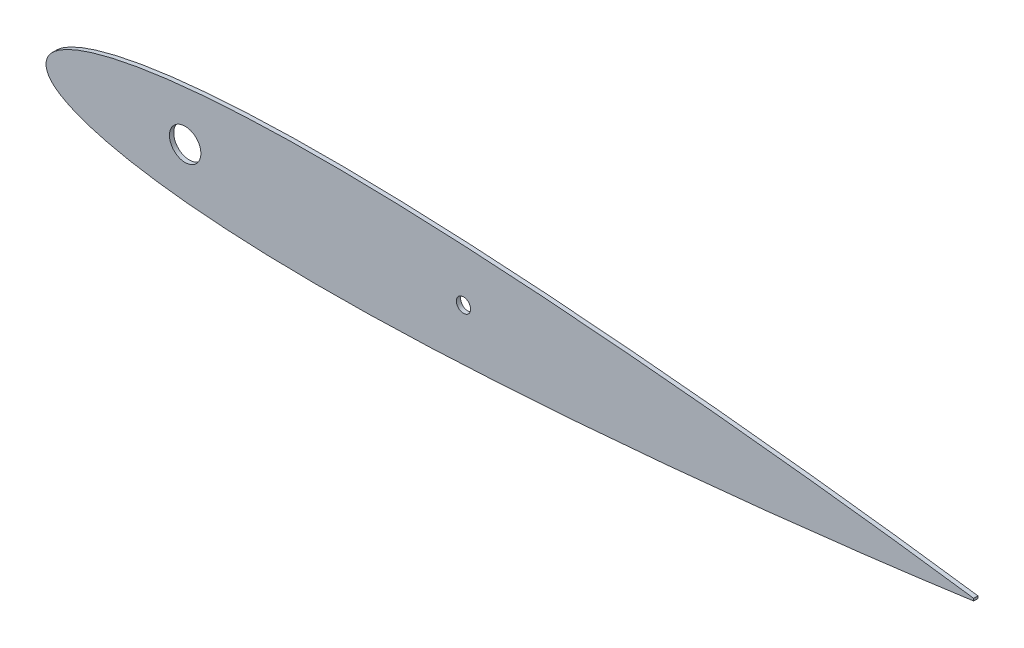
ISO-10303-21;
HEADER;
FILE_DESCRIPTION(('STEP AP214'),'2;1');
FILE_NAME('part.step','',(''),(''),'','','');
FILE_SCHEMA(('AUTOMOTIVE_DESIGN { 1 0 10303 214 1 1 1 1 }'));
ENDSEC;
DATA;
#1=APPLICATION_CONTEXT('core data for automotive mechanical design processes');
#2=APPLICATION_PROTOCOL_DEFINITION('international standard','automotive_design',2000,#1);
#3=PRODUCT_CONTEXT('',#1,'mechanical');
#4=PRODUCT('Part','Part','',(#3));
#5=PRODUCT_RELATED_PRODUCT_CATEGORY('part','',(#4));
#6=PRODUCT_DEFINITION_FORMATION('','',#4);
#7=PRODUCT_DEFINITION_CONTEXT('part definition',#1,'design');
#8=PRODUCT_DEFINITION('design','',#6,#7);
#9=PRODUCT_DEFINITION_SHAPE('','',#8);
#10=(LENGTH_UNIT() NAMED_UNIT(*) SI_UNIT(.MILLI.,.METRE.));
#11=(NAMED_UNIT(*) PLANE_ANGLE_UNIT() SI_UNIT($,.RADIAN.));
#12=(NAMED_UNIT(*) SI_UNIT($,.STERADIAN.) SOLID_ANGLE_UNIT());
#13=UNCERTAINTY_MEASURE_WITH_UNIT(LENGTH_MEASURE(1.E-05),#10,'distance_accuracy_value','');
#14=(GEOMETRIC_REPRESENTATION_CONTEXT(3) GLOBAL_UNCERTAINTY_ASSIGNED_CONTEXT((#13)) GLOBAL_UNIT_ASSIGNED_CONTEXT((#10,
#11,#12)) REPRESENTATION_CONTEXT('',''));
#15=CARTESIAN_POINT('',(0.,0.,0.));
#16=DIRECTION('',(0.,0.,1.));
#17=DIRECTION('',(1.,0.,0.));
#18=AXIS2_PLACEMENT_3D('',#15,#16,#17);
#19=CARTESIAN_POINT('',(325.,0.40950009294066,-1.5));
#20=CARTESIAN_POINT('',(324.209606779707,0.519399758052348,-1.5));
#21=CARTESIAN_POINT('',(322.004222005564,0.826045920870919,-1.5));
#22=CARTESIAN_POINT('',(318.131286115594,1.36247994030258,-1.5));
#23=CARTESIAN_POINT('',(313.205110101778,2.03042977355189,-1.5));
#24=CARTESIAN_POINT('',(307.754214134534,2.75656118582997,-1.5));
#25=CARTESIAN_POINT('',(301.981376014149,3.50796663812542,-1.5));
#26=CARTESIAN_POINT('',(296.03805070342,4.26285960586649,-1.5));
#27=CARTESIAN_POINT('',(290.014777157156,5.01477274252816,-1.5));
#28=CARTESIAN_POINT('',(283.957433959712,5.75582617177208,-1.5));
#29=CARTESIAN_POINT('',(277.884033962146,6.48070926721247,-1.5));
#30=CARTESIAN_POINT('',(271.799371840249,7.19115834138892,-1.5));
#31=CARTESIAN_POINT('',(265.708673260099,7.88859596106607,-1.5));
#32=CARTESIAN_POINT('',(259.617942627014,8.57158743858282,-1.5));
#33=CARTESIAN_POINT('',(253.527208066558,9.23757681253525,-1.5));
#34=CARTESIAN_POINT('',(247.432327629463,9.8867511540254,-1.5));
#35=CARTESIAN_POINT('',(241.332260132785,10.5225031273389,-1.5));
#36=CARTESIAN_POINT('',(235.230560492259,11.1447506557483,-1.5));
#37=CARTESIAN_POINT('',(229.13083924923,11.7508555070347,-1.5));
#38=CARTESIAN_POINT('',(223.034064985933,12.3409491955807,-1.5));
#39=CARTESIAN_POINT('',(216.939113887928,12.9142946059523,-1.5));
#40=CARTESIAN_POINT('',(210.845263014783,13.4708382241852,-1.5));
#41=CARTESIAN_POINT('',(204.753002950035,14.0095743054653,-1.5));
#42=CARTESIAN_POINT('',(198.663296519111,14.5308590099609,-1.5));
#43=CARTESIAN_POINT('',(192.576797706318,15.0327448367376,-1.5));
#44=CARTESIAN_POINT('',(186.493961902939,15.514677146349,-1.5));
#45=CARTESIAN_POINT('',(180.415624113057,15.976809619806,-1.5));
#46=CARTESIAN_POINT('',(174.342680028815,16.4170842141139,-1.5));
#47=CARTESIAN_POINT('',(168.275982363255,16.834029746551,-1.5));
#48=CARTESIAN_POINT('',(162.215629607513,17.2278742693415,-1.5));
#49=CARTESIAN_POINT('',(156.161040662733,17.5953372871967,-1.5));
#50=CARTESIAN_POINT('',(150.112779892537,17.9372096616028,-1.5));
#51=CARTESIAN_POINT('',(144.07339040427,18.2513514924439,-1.5));
#52=CARTESIAN_POINT('',(138.046350310496,18.5360668572563,-1.5));
#53=CARTESIAN_POINT('',(132.034044160048,18.7892202902569,-1.5));
#54=CARTESIAN_POINT('',(126.0357766507,19.0073658596619,-1.5));
#55=CARTESIAN_POINT('',(120.050052914781,19.1887400668421,-1.5));
#56=CARTESIAN_POINT('',(114.076331660156,19.3315438188049,-1.5));
#57=CARTESIAN_POINT('',(108.117235085,19.4351038734371,-1.5));
#58=CARTESIAN_POINT('',(102.177171609536,19.4963107318145,-1.5));
#59=CARTESIAN_POINT('',(96.2603591758063,19.5109725894809,-1.5));
#60=CARTESIAN_POINT('',(90.3701487394851,19.4775077461311,-1.5));
#61=CARTESIAN_POINT('',(84.5091329996222,19.3907618385162,-1.5));
#62=CARTESIAN_POINT('',(78.6807707597626,19.2476243031365,-1.5));
#63=CARTESIAN_POINT('',(72.8895764419092,19.0443694156848,-1.5));
#64=CARTESIAN_POINT('',(67.1420867990852,18.7758127059806,-1.5));
#65=CARTESIAN_POINT('',(61.4473554716222,18.4394562222855,-1.5));
#66=CARTESIAN_POINT('',(55.8188788592683,18.0277086658522,-1.5));
#67=CARTESIAN_POINT('',(50.2754905068751,17.5393749526799,-1.5));
#68=CARTESIAN_POINT('',(44.8436271748394,16.966812040394,-1.5));
#69=CARTESIAN_POINT('',(39.5585789155564,16.3084644660726,-1.5));
#70=CARTESIAN_POINT('',(34.4705276450858,15.5627624363054,-1.5));
#71=CARTESIAN_POINT('',(29.6466115538618,14.7371020011183,-1.5));
#72=CARTESIAN_POINT('',(25.1714180911801,13.847801872696,-1.5));
#73=CARTESIAN_POINT('',(21.1277937118719,12.9136079104224,-1.5));
#74=CARTESIAN_POINT('',(17.5697242584201,11.9649836606135,-1.5));
#75=CARTESIAN_POINT('',(14.5048810711102,11.0230017776016,-1.5));
#76=CARTESIAN_POINT('',(11.9002690745364,10.1112925690979,-1.5));
#77=CARTESIAN_POINT('',(9.70828673327445,9.23223688296203,-1.5));
#78=CARTESIAN_POINT('',(7.872827773427,8.39255923934498,-1.5));
#79=CARTESIAN_POINT('',(6.33315120465811,7.59484614670777,-1.5));
#80=CARTESIAN_POINT('',(5.03494774774102,6.82568841763676,-1.5));
#81=CARTESIAN_POINT('',(3.93051534393489,6.07372451832528,-1.5));
#82=CARTESIAN_POINT('',(2.98116190312313,5.33718940017341,-1.5));
#83=CARTESIAN_POINT('',(2.17337222995265,4.60407807520934,-1.5));
#84=CARTESIAN_POINT('',(1.50639491985586,3.86778199385349,-1.5));
#85=CARTESIAN_POINT('',(0.976010289153636,3.1318548172018,-1.5));
#86=CARTESIAN_POINT('',(0.573308222912487,2.40523809189426,-1.5));
#87=CARTESIAN_POINT('',(0.282112492358,1.69699756557867,-1.5));
#88=CARTESIAN_POINT('',(0.0927816593963797,1.00862248430008,-1.5));
#89=CARTESIAN_POINT('',(-0.00387542199195718,0.33472950833183,-1.5));
#90=CARTESIAN_POINT('',(-0.00387542199175771,-0.334729508332823,-1.5));
#91=CARTESIAN_POINT('',(0.0927816593964684,-1.00862248430101,-1.5));
#92=CARTESIAN_POINT('',(0.282112492358235,-1.69699756557957,-1.5));
#93=CARTESIAN_POINT('',(0.573308222913153,-2.40523809189516,-1.5));
#94=CARTESIAN_POINT('',(0.9760102891542,-3.13185481720265,-1.5));
#95=CARTESIAN_POINT('',(1.50639491985662,-3.8677819938538,-1.5));
#96=CARTESIAN_POINT('',(2.17337222995328,-4.60407807521171,-1.5));
#97=CARTESIAN_POINT('',(2.98116190312558,-5.33718940016606,-1.5));
#98=CARTESIAN_POINT('',(3.93051534393069,-6.07372451835894,-1.5));
#99=CARTESIAN_POINT('',(5.03494774776674,-6.8256884174897,-1.5));
#100=CARTESIAN_POINT('',(6.33315120454886,-7.59484614737165,-1.5));
#101=CARTESIAN_POINT('',(7.87282777394367,-8.3925592362581,-1.5));
#102=CARTESIAN_POINT('',(9.70828673083843,-9.23223689756835,-1.5));
#103=CARTESIAN_POINT('',(11.9002690861302,-10.1112924996382,-1.5));
#104=CARTESIAN_POINT('',(14.5048810162984,-11.023002106052,-1.5));
#105=CARTESIAN_POINT('',(17.5697245150947,-11.964982122603,-1.5));
#106=CARTESIAN_POINT('',(21.1277925315338,-12.9136149831514,-1.5));
#107=CARTESIAN_POINT('',(25.1714233397692,-13.84777042258,-1.5));
#108=CARTESIAN_POINT('',(29.6465711781048,-14.7372325178627,-1.5));
#109=CARTESIAN_POINT('',(34.4705986764644,-15.5622096745657,-1.5));
#110=CARTESIAN_POINT('',(39.5585394288991,-16.3086186388566,-1.5));
#111=CARTESIAN_POINT('',(44.8436338253308,-16.9667684771387,-1.5));
#112=CARTESIAN_POINT('',(50.2754886705653,-17.5393869812258,-1.5));
#113=CARTESIAN_POINT('',(55.8188793624641,-18.0277053697381,-1.5));
#114=CARTESIAN_POINT('',(61.447355334478,-18.439457120642,-1.5));
#115=CARTESIAN_POINT('',(67.1420868363349,-18.7758124619892,-1.5));
#116=CARTESIAN_POINT('',(72.8895764318215,-19.0443694817719,-1.5));
#117=CARTESIAN_POINT('',(78.6807707624954,-19.247624285242,-1.5));
#118=CARTESIAN_POINT('',(84.5091329988882,-19.3907618433306,-1.5));
#119=CARTESIAN_POINT('',(90.3701487396876,-19.4775077448096,-1.5));
#120=CARTESIAN_POINT('',(96.2603591757563,-19.5109725898143,-1.5));
#121=CARTESIAN_POINT('',(102.177171609554,-19.4963107316998,-1.5));
#122=CARTESIAN_POINT('',(108.117235085,-19.4351038734417,-1.5));
#123=CARTESIAN_POINT('',(114.076331660161,-19.3315438187759,-1.5));
#124=CARTESIAN_POINT('',(120.050052914784,-19.1887400668206,-1.5));
#125=CARTESIAN_POINT('',(126.035776650705,-19.0073658596369,-1.5));
#126=CARTESIAN_POINT('',(132.034044160051,-18.7892202902311,-1.5));
#127=CARTESIAN_POINT('',(138.046350310499,-18.5360668572293,-1.5));
#128=CARTESIAN_POINT('',(144.073390404273,-18.2513514924157,-1.5));
#129=CARTESIAN_POINT('',(150.11277989254,-17.9372096615734,-1.5));
#130=CARTESIAN_POINT('',(156.161040662736,-17.595337287166,-1.5));
#131=CARTESIAN_POINT('',(162.215629607516,-17.2278742693095,-1.5));
#132=CARTESIAN_POINT('',(168.275982363258,-16.8340297465178,-1.5));
#133=CARTESIAN_POINT('',(174.342680028818,-16.4170842140796,-1.5));
#134=CARTESIAN_POINT('',(180.41562411306,-15.9768096197705,-1.5));
#135=CARTESIAN_POINT('',(186.493961902942,-15.5146771463122,-1.5));
#136=CARTESIAN_POINT('',(192.57679770632,-15.0327448366995,-1.5));
#137=CARTESIAN_POINT('',(198.663296519114,-14.5308590099216,-1.5));
#138=CARTESIAN_POINT('',(204.753002950038,-14.0095743054248,-1.5));
#139=CARTESIAN_POINT('',(210.845263014786,-13.4708382241434,-1.5));
#140=CARTESIAN_POINT('',(216.93911388793,-12.9142946059093,-1.5));
#141=CARTESIAN_POINT('',(223.034064985936,-12.3409491955365,-1.5));
#142=CARTESIAN_POINT('',(229.130839249232,-11.7508555069892,-1.5));
#143=CARTESIAN_POINT('',(235.230560492261,-11.1447506557015,-1.5));
#144=CARTESIAN_POINT('',(241.332260132787,-10.5225031272909,-1.5));
#145=CARTESIAN_POINT('',(247.432327629465,-9.88675115397626,-1.5));
#146=CARTESIAN_POINT('',(253.527208066559,-9.23757681248485,-1.5));
#147=CARTESIAN_POINT('',(259.617942627016,-8.57158743853121,-1.5));
#148=CARTESIAN_POINT('',(265.7086732601,-7.88859596101316,-1.5));
#149=CARTESIAN_POINT('',(271.79937184025,-7.19115834133485,-1.5));
#150=CARTESIAN_POINT('',(277.884033962148,-6.48070926715712,-1.5));
#151=CARTESIAN_POINT('',(283.957433959714,-5.75582617171553,-1.5));
#152=CARTESIAN_POINT('',(290.014777157157,-5.01477274247036,-1.5));
#153=CARTESIAN_POINT('',(296.038050703421,-4.26285960580745,-1.5));
#154=CARTESIAN_POINT('',(301.98137601415,-3.50796663806521,-1.5));
#155=CARTESIAN_POINT('',(307.754214134535,-2.75656118576856,-1.5));
#156=CARTESIAN_POINT('',(313.205110101779,-2.0304297734894,-1.5));
#157=CARTESIAN_POINT('',(318.131286115594,-1.36247994023909,-1.5));
#158=CARTESIAN_POINT('',(322.004222005564,-0.826045920806638,-1.5));
#159=CARTESIAN_POINT('',(324.209606779707,-0.519399757987628,-1.5));
#160=CARTESIAN_POINT('',(325.,-0.409500092875768,-1.5));
#161=B_SPLINE_CURVE_WITH_KNOTS('',3,(#19,#20,#21,#22,#23,#24,#25,#26,#27,#28,#29,#30,#31,#32,
#33,#34,#35,#36,#37,#38,#39,#40,#41,#42,#43,#44,#45,#46,#47,#48,#49,#50,#51,#52,#53,#54,#55,#56,
#57,#58,#59,#60,#61,#62,#63,#64,#65,#66,#67,#68,#69,#70,#71,#72,#73,#74,#75,#76,#77,#78,#79,#80,
#81,#82,#83,#84,#85,#86,#87,#88,#89,#90,#91,#92,#93,#94,#95,#96,#97,#98,#99,#100,#101,#102,#103,
#104,#105,#106,#107,#108,#109,#110,#111,#112,#113,#114,#115,#116,#117,#118,#119,#120,#121,#122,
#123,#124,#125,#126,#127,#128,#129,#130,#131,#132,#133,#134,#135,#136,#137,#138,#139,#140,#141,
#142,#143,#144,#145,#146,#147,#148,#149,#150,#151,#152,#153,#154,#155,#156,#157,#158,#159,#160),
.UNSPECIFIED.,.F.,.F.,(4,1,1,1,1,1,1,1,1,1,1,1,1,1,1,1,1,1,1,1,1,1,1,1,1,1,1,1,1,1,1,1,1,1,1,1,
1,1,1,1,1,1,1,1,1,1,1,1,1,1,1,1,1,1,1,1,1,1,1,1,1,1,1,1,1,1,1,1,1,1,1,1,1,1,1,1,1,1,1,1,1,1,1,1,
1,1,1,1,1,1,1,1,1,1,1,1,1,1,1,1,1,1,1,1,1,1,1,1,1,1,1,1,1,1,1,1,1,1,1,1,1,1,1,1,1,1,1,1,1,1,1,1,
1,1,1,1,1,1,1,4),(0.,0.00361222059404388,0.0100789532278554,0.0176986181570895,
0.0261151107220122,0.0349709660638799,0.0440503796486832,0.0532343297369713,0.0624475697827881,
0.0716739929600303,0.0809213185094618,0.0901775382979332,0.0994243421366575,0.108664440992277,
0.117912199004999,0.127169502180609,0.136426594565023,0.145675425736823,0.154916495397513,
0.164153236916375,0.173386648526191,0.182615736180586,0.191838089492061,0.201053134496137,
0.210260392550908,0.219458942389608,0.228646746886173,0.237822316287067,0.24698522413025,
0.25613738364592,0.265279415916296,0.274406949966901,0.283512193452554,0.292591781113348,
0.30164628535433,0.310681792653752,0.31969906757785,0.32869451957993,0.337660159695399,
0.346588583205171,0.355477411634764,0.364322937295264,0.373121613643215,0.381867635356829,
0.390553004884712,0.399166025869356,0.407689628257838,0.416098119030288,0.424354887451602,
0.432412428746428,0.440204728485537,0.447630505181733,0.454563637698397,0.460855379429517,
0.466413319364109,0.471228610451128,0.475365774282038,0.478901259753558,0.481915077255184,
0.484498871900912,0.486747127386087,0.488741251833575,0.490543179252672,0.492182103901344,
0.493672830547239,0.495031907807012,0.496279059618418,0.497424736506128,0.498490165528455,
0.499502757789975,0.500497253863142,0.501509846124661,0.502575275146988,0.503720952034698,
0.504968103846104,0.506327181105877,0.507817907751772,0.509456832400444,0.511258759819541,
0.51325288426703,0.515501139752205,0.518084934397933,0.521098751899559,0.524634237371078,
0.528771401201989,0.533586692289008,0.539144632223599,0.545436373954719,0.552369506471383,
0.559795200118754,0.567587571253572,0.575645112548398,0.583901880969712,0.592310371742162,
0.600833974130644,0.609446995115288,0.618132364643171,0.626878386356785,0.635677062704736,
0.644522588365236,0.653411416794829,0.662339840304601,0.67130548042007,0.68030093242215,
0.689318207346248,0.69835371464567,0.707408218886652,0.716487806547446,0.725593050033099,
0.734720584083704,0.74386261635408,0.75301477586975,0.762177683712933,0.771353253113827,
0.780541057610392,0.789739607449093,0.798946865503863,0.808161910507939,0.817384263819414,
0.826613351473809,0.835846763083625,0.845083504602487,0.854324574263177,0.863573405434977,
0.872830497819391,0.882087800995001,0.891335559007723,0.900575657863343,0.909822461702067,
0.919078681490538,0.92832600703997,0.937552430217212,0.946765670263029,0.955949620351317,
0.96502903393612,0.973884889277988,0.982301381842911,0.989921046772145,0.996387779405956,1.),.UNSPECIFIED.);
#162=DIRECTION('',(0.,0.,1.));
#163=VECTOR('',#162,1.);
#164=SURFACE_OF_LINEAR_EXTRUSION('',#161,#163);
#165=CARTESIAN_POINT('',(325.,0.40950009294066,0.));
#166=CARTESIAN_POINT('',(324.209606779707,0.519399758052348,0.));
#167=CARTESIAN_POINT('',(322.004222005564,0.826045920870919,0.));
#168=CARTESIAN_POINT('',(318.131286115594,1.36247994030258,0.));
#169=CARTESIAN_POINT('',(313.205110101778,2.03042977355189,0.));
#170=CARTESIAN_POINT('',(307.754214134534,2.75656118582997,0.));
#171=CARTESIAN_POINT('',(301.981376014149,3.50796663812542,0.));
#172=CARTESIAN_POINT('',(296.03805070342,4.26285960586649,0.));
#173=CARTESIAN_POINT('',(290.014777157156,5.01477274252816,0.));
#174=CARTESIAN_POINT('',(283.957433959712,5.75582617177208,0.));
#175=CARTESIAN_POINT('',(277.884033962146,6.48070926721247,0.));
#176=CARTESIAN_POINT('',(271.799371840249,7.19115834138892,0.));
#177=CARTESIAN_POINT('',(265.708673260099,7.88859596106607,0.));
#178=CARTESIAN_POINT('',(259.617942627014,8.57158743858282,0.));
#179=CARTESIAN_POINT('',(253.527208066558,9.23757681253525,0.));
#180=CARTESIAN_POINT('',(247.432327629463,9.8867511540254,0.));
#181=CARTESIAN_POINT('',(241.332260132785,10.5225031273389,0.));
#182=CARTESIAN_POINT('',(235.230560492259,11.1447506557483,0.));
#183=CARTESIAN_POINT('',(229.13083924923,11.7508555070347,0.));
#184=CARTESIAN_POINT('',(223.034064985933,12.3409491955807,0.));
#185=CARTESIAN_POINT('',(216.939113887928,12.9142946059523,0.));
#186=CARTESIAN_POINT('',(210.845263014783,13.4708382241852,0.));
#187=CARTESIAN_POINT('',(204.753002950035,14.0095743054653,0.));
#188=CARTESIAN_POINT('',(198.663296519111,14.5308590099609,0.));
#189=CARTESIAN_POINT('',(192.576797706318,15.0327448367376,0.));
#190=CARTESIAN_POINT('',(186.493961902939,15.514677146349,0.));
#191=CARTESIAN_POINT('',(180.415624113057,15.976809619806,0.));
#192=CARTESIAN_POINT('',(174.342680028815,16.4170842141139,0.));
#193=CARTESIAN_POINT('',(168.275982363255,16.834029746551,0.));
#194=CARTESIAN_POINT('',(162.215629607513,17.2278742693415,0.));
#195=CARTESIAN_POINT('',(156.161040662733,17.5953372871967,0.));
#196=CARTESIAN_POINT('',(150.112779892537,17.9372096616028,0.));
#197=CARTESIAN_POINT('',(144.07339040427,18.2513514924439,0.));
#198=CARTESIAN_POINT('',(138.046350310496,18.5360668572563,0.));
#199=CARTESIAN_POINT('',(132.034044160048,18.7892202902569,0.));
#200=CARTESIAN_POINT('',(126.0357766507,19.0073658596619,0.));
#201=CARTESIAN_POINT('',(120.050052914781,19.1887400668421,0.));
#202=CARTESIAN_POINT('',(114.076331660156,19.3315438188049,0.));
#203=CARTESIAN_POINT('',(108.117235085,19.4351038734371,0.));
#204=CARTESIAN_POINT('',(102.177171609536,19.4963107318145,0.));
#205=CARTESIAN_POINT('',(96.2603591758063,19.5109725894809,0.));
#206=CARTESIAN_POINT('',(90.3701487394851,19.4775077461311,0.));
#207=CARTESIAN_POINT('',(84.5091329996222,19.3907618385162,0.));
#208=CARTESIAN_POINT('',(78.6807707597626,19.2476243031365,0.));
#209=CARTESIAN_POINT('',(72.8895764419092,19.0443694156848,0.));
#210=CARTESIAN_POINT('',(67.1420867990852,18.7758127059806,0.));
#211=CARTESIAN_POINT('',(61.4473554716222,18.4394562222855,0.));
#212=CARTESIAN_POINT('',(55.8188788592683,18.0277086658522,0.));
#213=CARTESIAN_POINT('',(50.2754905068751,17.5393749526799,0.));
#214=CARTESIAN_POINT('',(44.8436271748394,16.966812040394,0.));
#215=CARTESIAN_POINT('',(39.5585789155564,16.3084644660726,0.));
#216=CARTESIAN_POINT('',(34.4705276450858,15.5627624363054,0.));
#217=CARTESIAN_POINT('',(29.6466115538618,14.7371020011183,0.));
#218=CARTESIAN_POINT('',(25.1714180911801,13.847801872696,0.));
#219=CARTESIAN_POINT('',(21.1277937118719,12.9136079104224,0.));
#220=CARTESIAN_POINT('',(17.5697242584201,11.9649836606135,0.));
#221=CARTESIAN_POINT('',(14.5048810711102,11.0230017776016,0.));
#222=CARTESIAN_POINT('',(11.9002690745364,10.1112925690979,0.));
#223=CARTESIAN_POINT('',(9.70828673327445,9.23223688296203,0.));
#224=CARTESIAN_POINT('',(7.872827773427,8.39255923934498,0.));
#225=CARTESIAN_POINT('',(6.33315120465811,7.59484614670777,0.));
#226=CARTESIAN_POINT('',(5.03494774774102,6.82568841763676,0.));
#227=CARTESIAN_POINT('',(3.93051534393489,6.07372451832528,0.));
#228=CARTESIAN_POINT('',(2.98116190312313,5.33718940017341,0.));
#229=CARTESIAN_POINT('',(2.17337222995265,4.60407807520934,0.));
#230=CARTESIAN_POINT('',(1.50639491985586,3.86778199385349,0.));
#231=CARTESIAN_POINT('',(0.976010289153636,3.1318548172018,0.));
#232=CARTESIAN_POINT('',(0.573308222912487,2.40523809189426,0.));
#233=CARTESIAN_POINT('',(0.282112492358,1.69699756557867,0.));
#234=CARTESIAN_POINT('',(0.0927816593963797,1.00862248430008,0.));
#235=CARTESIAN_POINT('',(-0.00387542199195718,0.33472950833183,0.));
#236=CARTESIAN_POINT('',(-0.00387542199175771,-0.334729508332823,0.));
#237=CARTESIAN_POINT('',(0.0927816593964684,-1.00862248430101,0.));
#238=CARTESIAN_POINT('',(0.282112492358235,-1.69699756557957,0.));
#239=CARTESIAN_POINT('',(0.573308222913153,-2.40523809189516,0.));
#240=CARTESIAN_POINT('',(0.9760102891542,-3.13185481720265,0.));
#241=CARTESIAN_POINT('',(1.50639491985662,-3.8677819938538,0.));
#242=CARTESIAN_POINT('',(2.17337222995328,-4.60407807521171,0.));
#243=CARTESIAN_POINT('',(2.98116190312558,-5.33718940016606,0.));
#244=CARTESIAN_POINT('',(3.93051534393069,-6.07372451835894,0.));
#245=CARTESIAN_POINT('',(5.03494774776674,-6.8256884174897,0.));
#246=CARTESIAN_POINT('',(6.33315120454886,-7.59484614737165,0.));
#247=CARTESIAN_POINT('',(7.87282777394367,-8.3925592362581,0.));
#248=CARTESIAN_POINT('',(9.70828673083843,-9.23223689756835,0.));
#249=CARTESIAN_POINT('',(11.9002690861302,-10.1112924996382,0.));
#250=CARTESIAN_POINT('',(14.5048810162984,-11.023002106052,0.));
#251=CARTESIAN_POINT('',(17.5697245150947,-11.964982122603,0.));
#252=CARTESIAN_POINT('',(21.1277925315338,-12.9136149831514,0.));
#253=CARTESIAN_POINT('',(25.1714233397692,-13.84777042258,0.));
#254=CARTESIAN_POINT('',(29.6465711781048,-14.7372325178627,0.));
#255=CARTESIAN_POINT('',(34.4705986764644,-15.5622096745657,0.));
#256=CARTESIAN_POINT('',(39.5585394288991,-16.3086186388566,0.));
#257=CARTESIAN_POINT('',(44.8436338253308,-16.9667684771387,0.));
#258=CARTESIAN_POINT('',(50.2754886705653,-17.5393869812258,0.));
#259=CARTESIAN_POINT('',(55.8188793624641,-18.0277053697381,0.));
#260=CARTESIAN_POINT('',(61.447355334478,-18.439457120642,0.));
#261=CARTESIAN_POINT('',(67.1420868363349,-18.7758124619892,0.));
#262=CARTESIAN_POINT('',(72.8895764318215,-19.0443694817719,0.));
#263=CARTESIAN_POINT('',(78.6807707624954,-19.247624285242,0.));
#264=CARTESIAN_POINT('',(84.5091329988882,-19.3907618433306,0.));
#265=CARTESIAN_POINT('',(90.3701487396876,-19.4775077448096,0.));
#266=CARTESIAN_POINT('',(96.2603591757563,-19.5109725898143,0.));
#267=CARTESIAN_POINT('',(102.177171609554,-19.4963107316998,0.));
#268=CARTESIAN_POINT('',(108.117235085,-19.4351038734417,0.));
#269=CARTESIAN_POINT('',(114.076331660161,-19.3315438187759,0.));
#270=CARTESIAN_POINT('',(120.050052914784,-19.1887400668206,0.));
#271=CARTESIAN_POINT('',(126.035776650705,-19.0073658596369,0.));
#272=CARTESIAN_POINT('',(132.034044160051,-18.7892202902311,0.));
#273=CARTESIAN_POINT('',(138.046350310499,-18.5360668572293,0.));
#274=CARTESIAN_POINT('',(144.073390404273,-18.2513514924157,0.));
#275=CARTESIAN_POINT('',(150.11277989254,-17.9372096615734,0.));
#276=CARTESIAN_POINT('',(156.161040662736,-17.595337287166,0.));
#277=CARTESIAN_POINT('',(162.215629607516,-17.2278742693095,0.));
#278=CARTESIAN_POINT('',(168.275982363258,-16.8340297465178,0.));
#279=CARTESIAN_POINT('',(174.342680028818,-16.4170842140796,0.));
#280=CARTESIAN_POINT('',(180.41562411306,-15.9768096197705,0.));
#281=CARTESIAN_POINT('',(186.493961902942,-15.5146771463122,0.));
#282=CARTESIAN_POINT('',(192.57679770632,-15.0327448366995,0.));
#283=CARTESIAN_POINT('',(198.663296519114,-14.5308590099216,0.));
#284=CARTESIAN_POINT('',(204.753002950038,-14.0095743054248,0.));
#285=CARTESIAN_POINT('',(210.845263014786,-13.4708382241434,0.));
#286=CARTESIAN_POINT('',(216.93911388793,-12.9142946059093,0.));
#287=CARTESIAN_POINT('',(223.034064985936,-12.3409491955365,0.));
#288=CARTESIAN_POINT('',(229.130839249232,-11.7508555069892,0.));
#289=CARTESIAN_POINT('',(235.230560492261,-11.1447506557015,0.));
#290=CARTESIAN_POINT('',(241.332260132787,-10.5225031272909,0.));
#291=CARTESIAN_POINT('',(247.432327629465,-9.88675115397626,0.));
#292=CARTESIAN_POINT('',(253.527208066559,-9.23757681248485,0.));
#293=CARTESIAN_POINT('',(259.617942627016,-8.57158743853121,0.));
#294=CARTESIAN_POINT('',(265.7086732601,-7.88859596101316,0.));
#295=CARTESIAN_POINT('',(271.79937184025,-7.19115834133485,0.));
#296=CARTESIAN_POINT('',(277.884033962148,-6.48070926715712,0.));
#297=CARTESIAN_POINT('',(283.957433959714,-5.75582617171553,0.));
#298=CARTESIAN_POINT('',(290.014777157157,-5.01477274247036,0.));
#299=CARTESIAN_POINT('',(296.038050703421,-4.26285960580745,0.));
#300=CARTESIAN_POINT('',(301.98137601415,-3.50796663806521,0.));
#301=CARTESIAN_POINT('',(307.754214134535,-2.75656118576856,0.));
#302=CARTESIAN_POINT('',(313.205110101779,-2.0304297734894,0.));
#303=CARTESIAN_POINT('',(318.131286115594,-1.36247994023909,0.));
#304=CARTESIAN_POINT('',(322.004222005564,-0.826045920806638,0.));
#305=CARTESIAN_POINT('',(324.209606779707,-0.519399757987628,0.));
#306=CARTESIAN_POINT('',(325.,-0.409500092875768,0.));
#307=B_SPLINE_CURVE_WITH_KNOTS('',3,(#165,#166,#167,#168,#169,#170,#171,#172,#173,#174,#175,
#176,#177,#178,#179,#180,#181,#182,#183,#184,#185,#186,#187,#188,#189,#190,#191,#192,#193,#194,
#195,#196,#197,#198,#199,#200,#201,#202,#203,#204,#205,#206,#207,#208,#209,#210,#211,#212,#213,
#214,#215,#216,#217,#218,#219,#220,#221,#222,#223,#224,#225,#226,#227,#228,#229,#230,#231,#232,
#233,#234,#235,#236,#237,#238,#239,#240,#241,#242,#243,#244,#245,#246,#247,#248,#249,#250,#251,
#252,#253,#254,#255,#256,#257,#258,#259,#260,#261,#262,#263,#264,#265,#266,#267,#268,#269,#270,
#271,#272,#273,#274,#275,#276,#277,#278,#279,#280,#281,#282,#283,#284,#285,#286,#287,#288,#289,
#290,#291,#292,#293,#294,#295,#296,#297,#298,#299,#300,#301,#302,#303,#304,#305,#306),
.UNSPECIFIED.,.F.,.F.,(4,1,1,1,1,1,1,1,1,1,1,1,1,1,1,1,1,1,1,1,1,1,1,1,1,1,1,1,1,1,1,1,1,1,1,1,
1,1,1,1,1,1,1,1,1,1,1,1,1,1,1,1,1,1,1,1,1,1,1,1,1,1,1,1,1,1,1,1,1,1,1,1,1,1,1,1,1,1,1,1,1,1,1,1,
1,1,1,1,1,1,1,1,1,1,1,1,1,1,1,1,1,1,1,1,1,1,1,1,1,1,1,1,1,1,1,1,1,1,1,1,1,1,1,1,1,1,1,1,1,1,1,1,
1,1,1,1,1,1,1,4),(0.,0.00361222059404388,0.0100789532278554,0.0176986181570895,
0.0261151107220122,0.0349709660638799,0.0440503796486832,0.0532343297369713,0.0624475697827881,
0.0716739929600303,0.0809213185094618,0.0901775382979332,0.0994243421366575,0.108664440992277,
0.117912199004999,0.127169502180609,0.136426594565023,0.145675425736823,0.154916495397513,
0.164153236916375,0.173386648526191,0.182615736180586,0.191838089492061,0.201053134496137,
0.210260392550908,0.219458942389608,0.228646746886173,0.237822316287067,0.24698522413025,
0.25613738364592,0.265279415916296,0.274406949966901,0.283512193452554,0.292591781113348,
0.30164628535433,0.310681792653752,0.31969906757785,0.32869451957993,0.337660159695399,
0.346588583205171,0.355477411634764,0.364322937295264,0.373121613643215,0.381867635356829,
0.390553004884712,0.399166025869356,0.407689628257838,0.416098119030288,0.424354887451602,
0.432412428746428,0.440204728485537,0.447630505181733,0.454563637698397,0.460855379429517,
0.466413319364109,0.471228610451128,0.475365774282038,0.478901259753558,0.481915077255184,
0.484498871900912,0.486747127386087,0.488741251833575,0.490543179252672,0.492182103901344,
0.493672830547239,0.495031907807012,0.496279059618418,0.497424736506128,0.498490165528455,
0.499502757789975,0.500497253863142,0.501509846124661,0.502575275146988,0.503720952034698,
0.504968103846104,0.506327181105877,0.507817907751772,0.509456832400444,0.511258759819541,
0.51325288426703,0.515501139752205,0.518084934397933,0.521098751899559,0.524634237371078,
0.528771401201989,0.533586692289008,0.539144632223599,0.545436373954719,0.552369506471383,
0.559795200118754,0.567587571253572,0.575645112548398,0.583901880969712,0.592310371742162,
0.600833974130644,0.609446995115288,0.618132364643171,0.626878386356785,0.635677062704736,
0.644522588365236,0.653411416794829,0.662339840304601,0.67130548042007,0.68030093242215,
0.689318207346248,0.69835371464567,0.707408218886652,0.716487806547446,0.725593050033099,
0.734720584083704,0.74386261635408,0.75301477586975,0.762177683712933,0.771353253113827,
0.780541057610392,0.789739607449093,0.798946865503863,0.808161910507939,0.817384263819414,
0.826613351473809,0.835846763083625,0.845083504602487,0.854324574263177,0.863573405434977,
0.872830497819391,0.882087800995001,0.891335559007723,0.900575657863343,0.909822461702067,
0.919078681490538,0.92832600703997,0.937552430217212,0.946765670263029,0.955949620351317,
0.96502903393612,0.973884889277988,0.982301381842911,0.989921046772145,0.996387779405956,1.),.UNSPECIFIED.);
#308=CARTESIAN_POINT('',(325.,0.40950009294066,0.));
#309=VERTEX_POINT('',#308);
#310=CARTESIAN_POINT('',(325.,-0.409500092875768,0.));
#311=VERTEX_POINT('',#310);
#312=EDGE_CURVE('E63',#309,#311,#307,.T.);
#313=ORIENTED_EDGE('',*,*,#312,.F.);
#314=DIRECTION('',(0.,0.,1.));
#315=VECTOR('',#314,1.);
#316=CARTESIAN_POINT('',(325.,0.40950009294066,-1.5));
#317=LINE('',#316,#315);
#318=CARTESIAN_POINT('',(325.,0.40950009294066,-1.5));
#319=VERTEX_POINT('',#318);
#320=EDGE_CURVE('E44',#319,#309,#317,.T.);
#321=ORIENTED_EDGE('',*,*,#320,.F.);
#322=CARTESIAN_POINT('',(325.,-0.409500092875768,-1.5));
#323=VERTEX_POINT('',#322);
#324=EDGE_CURVE('E64',#319,#323,#161,.T.);
#325=ORIENTED_EDGE('',*,*,#324,.T.);
#326=DIRECTION('',(0.,0.,1.));
#327=VECTOR('',#326,1.);
#328=CARTESIAN_POINT('',(325.,-0.409500092875768,-1.5));
#329=LINE('',#328,#327);
#330=EDGE_CURVE('E11',#323,#311,#329,.T.);
#331=ORIENTED_EDGE('',*,*,#330,.T.);
#332=EDGE_LOOP('',(#313,#321,#325,#331));
#333=FACE_BOUND('',#332,.T.);
#334=ADVANCED_FACE('F35',(#333),#164,.T.);
#335=CARTESIAN_POINT('',(325.,0.40950009294066,-1.5));
#336=DIRECTION('',(-1.,0.,0.));
#337=DIRECTION('',(0.,0.,-1.));
#338=AXIS2_PLACEMENT_3D('',#335,#336,#337);
#339=PLANE('',#338);
#340=DIRECTION('',(0.,1.,0.));
#341=VECTOR('',#340,1.);
#342=CARTESIAN_POINT('',(325.,0.40950009294066,0.));
#343=LINE('',#342,#341);
#344=EDGE_CURVE('E58',#311,#309,#343,.T.);
#345=ORIENTED_EDGE('',*,*,#344,.F.);
#346=ORIENTED_EDGE('',*,*,#330,.F.);
#347=DIRECTION('',(0.,1.,0.));
#348=VECTOR('',#347,1.);
#349=CARTESIAN_POINT('',(325.,0.40950009294066,-1.5));
#350=LINE('',#349,#348);
#351=EDGE_CURVE('E52',#323,#319,#350,.T.);
#352=ORIENTED_EDGE('',*,*,#351,.T.);
#353=ORIENTED_EDGE('',*,*,#320,.T.);
#354=EDGE_LOOP('',(#345,#346,#352,#353));
#355=FACE_BOUND('',#354,.T.);
#356=ADVANCED_FACE('F67',(#355),#339,.F.);
#357=CARTESIAN_POINT('',(1.58527269683665E-12,3.86495866462209E-06,-1.5));
#358=DIRECTION('',(0.,0.,1.));
#359=DIRECTION('',(-1.,0.,0.));
#360=AXIS2_PLACEMENT_3D('',#357,#358,#359);
#361=PLANE('',#360);
#362=CARTESIAN_POINT('',(48.75,0.,-1.5));
#363=DIRECTION('',(0.,0.,1.));
#364=DIRECTION('',(1.,0.,0.));
#365=AXIS2_PLACEMENT_3D('',#362,#363,#364);
#366=CIRCLE('',#365,5.50000000000002);
#367=CARTESIAN_POINT('',(54.25,0.,-1.5));
#368=VERTEX_POINT('',#367);
#369=EDGE_CURVE('E73',#368,#368,#366,.T.);
#370=ORIENTED_EDGE('',*,*,#369,.T.);
#371=EDGE_LOOP('',(#370));
#372=FACE_BOUND('',#371,.T.);
#373=CARTESIAN_POINT('',(146.25,0.,-1.5));
#374=DIRECTION('',(0.,0.,1.));
#375=DIRECTION('',(1.,0.,0.));
#376=AXIS2_PLACEMENT_3D('',#373,#374,#375);
#377=CIRCLE('',#376,2.50000000000002);
#378=CARTESIAN_POINT('',(148.75,0.,-1.5));
#379=VERTEX_POINT('',#378);
#380=EDGE_CURVE('E85',#379,#379,#377,.T.);
#381=ORIENTED_EDGE('',*,*,#380,.T.);
#382=EDGE_LOOP('',(#381));
#383=FACE_BOUND('',#382,.T.);
#384=ORIENTED_EDGE('',*,*,#324,.F.);
#385=ORIENTED_EDGE('',*,*,#351,.F.);
#386=EDGE_LOOP('',(#384,#385));
#387=FACE_BOUND('',#386,.T.);
#388=ADVANCED_FACE('F97',(#372,#383,#387),#361,.F.);
#389=CARTESIAN_POINT('',(1.58527269683665E-12,3.86495866462209E-06,0.));
#390=DIRECTION('',(0.,0.,1.));
#391=DIRECTION('',(-1.,0.,0.));
#392=AXIS2_PLACEMENT_3D('',#389,#390,#391);
#393=PLANE('',#392);
#394=CARTESIAN_POINT('',(48.75,0.,0.));
#395=DIRECTION('',(0.,0.,1.));
#396=DIRECTION('',(1.,0.,0.));
#397=AXIS2_PLACEMENT_3D('',#394,#395,#396);
#398=CIRCLE('',#397,5.50000000000002);
#399=CARTESIAN_POINT('',(54.25,0.,0.));
#400=VERTEX_POINT('',#399);
#401=EDGE_CURVE('E70',#400,#400,#398,.T.);
#402=ORIENTED_EDGE('',*,*,#401,.F.);
#403=EDGE_LOOP('',(#402));
#404=FACE_BOUND('',#403,.T.);
#405=CARTESIAN_POINT('',(146.25,0.,0.));
#406=DIRECTION('',(0.,0.,1.));
#407=DIRECTION('',(1.,0.,0.));
#408=AXIS2_PLACEMENT_3D('',#405,#406,#407);
#409=CIRCLE('',#408,2.50000000000002);
#410=CARTESIAN_POINT('',(148.75,0.,0.));
#411=VERTEX_POINT('',#410);
#412=EDGE_CURVE('E91',#411,#411,#409,.T.);
#413=ORIENTED_EDGE('',*,*,#412,.F.);
#414=EDGE_LOOP('',(#413));
#415=FACE_BOUND('',#414,.T.);
#416=ORIENTED_EDGE('',*,*,#312,.T.);
#417=ORIENTED_EDGE('',*,*,#344,.T.);
#418=EDGE_LOOP('',(#416,#417));
#419=FACE_BOUND('',#418,.T.);
#420=ADVANCED_FACE('F61',(#404,#415,#419),#393,.T.);
#421=CARTESIAN_POINT('',(146.25,0.,0.));
#422=DIRECTION('',(0.,0.,-1.));
#423=DIRECTION('',(1.,0.,0.));
#424=AXIS2_PLACEMENT_3D('',#421,#422,#423);
#425=CYLINDRICAL_SURFACE('',#424,2.50000000000002);
#426=ORIENTED_EDGE('',*,*,#412,.T.);
#427=EDGE_LOOP('',(#426));
#428=FACE_BOUND('',#427,.T.);
#429=ORIENTED_EDGE('',*,*,#380,.F.);
#430=EDGE_LOOP('',(#429));
#431=FACE_BOUND('',#430,.T.);
#432=ADVANCED_FACE('F102',(#428,#431),#425,.F.);
#433=CARTESIAN_POINT('',(48.75,0.,0.));
#434=DIRECTION('',(0.,0.,-1.));
#435=DIRECTION('',(1.,0.,0.));
#436=AXIS2_PLACEMENT_3D('',#433,#434,#435);
#437=CYLINDRICAL_SURFACE('',#436,5.50000000000002);
#438=ORIENTED_EDGE('',*,*,#401,.T.);
#439=EDGE_LOOP('',(#438));
#440=FACE_BOUND('',#439,.T.);
#441=ORIENTED_EDGE('',*,*,#369,.F.);
#442=EDGE_LOOP('',(#441));
#443=FACE_BOUND('',#442,.T.);
#444=ADVANCED_FACE('F100',(#440,#443),#437,.F.);
#445=CLOSED_SHELL('',(#334,#356,#388,#420,#432,#444));
#446=MANIFOLD_SOLID_BREP('B2',#445);
#447=ADVANCED_BREP_SHAPE_REPRESENTATION('',(#18,#446),#14);
#448=SHAPE_DEFINITION_REPRESENTATION(#9,#447);
ENDSEC;
END-ISO-10303-21;
